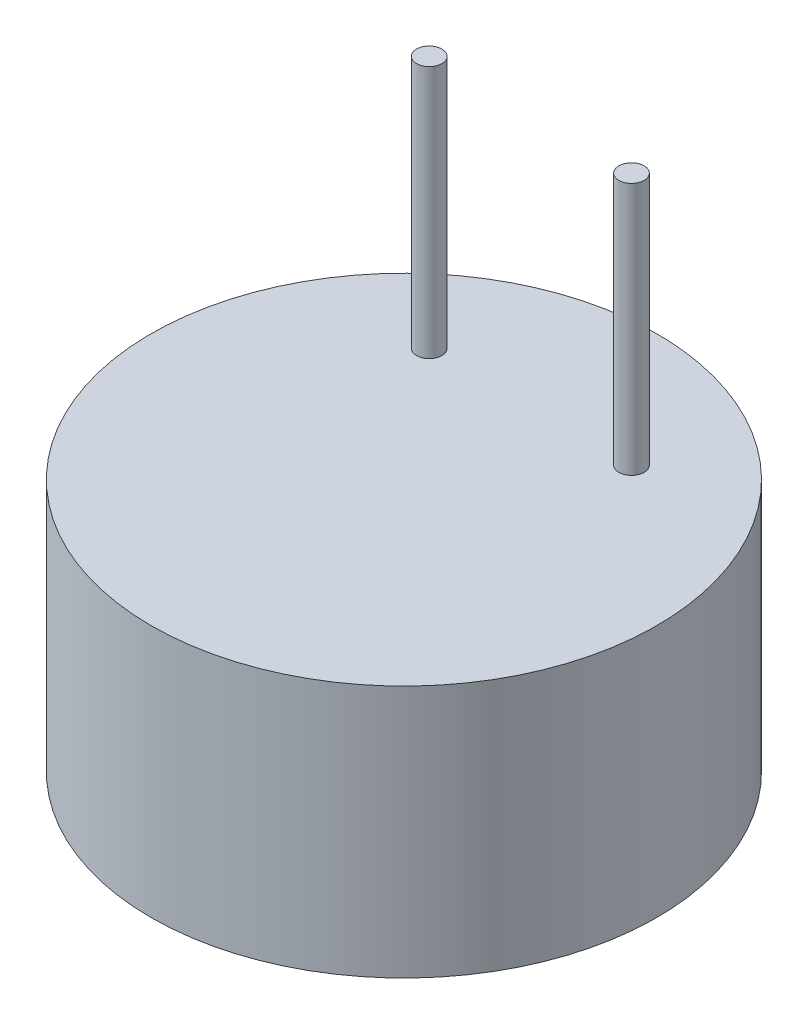
ISO-10303-21;
HEADER;
FILE_DESCRIPTION(('STEP AP214'),'2;1');
FILE_NAME('part.step','',(''),(''),'','','');
FILE_SCHEMA(('AUTOMOTIVE_DESIGN { 1 0 10303 214 1 1 1 1 }'));
ENDSEC;
DATA;
#1=APPLICATION_CONTEXT('core data for automotive mechanical design processes');
#2=APPLICATION_PROTOCOL_DEFINITION('international standard','automotive_design',2000,#1);
#3=PRODUCT_CONTEXT('',#1,'mechanical');
#4=PRODUCT('Part','Part','',(#3));
#5=PRODUCT_RELATED_PRODUCT_CATEGORY('part','',(#4));
#6=PRODUCT_DEFINITION_FORMATION('','',#4);
#7=PRODUCT_DEFINITION_CONTEXT('part definition',#1,'design');
#8=PRODUCT_DEFINITION('design','',#6,#7);
#9=PRODUCT_DEFINITION_SHAPE('','',#8);
#10=(LENGTH_UNIT() NAMED_UNIT(*) SI_UNIT(.MILLI.,.METRE.));
#11=(NAMED_UNIT(*) PLANE_ANGLE_UNIT() SI_UNIT($,.RADIAN.));
#12=(NAMED_UNIT(*) SI_UNIT($,.STERADIAN.) SOLID_ANGLE_UNIT());
#13=UNCERTAINTY_MEASURE_WITH_UNIT(LENGTH_MEASURE(1.E-05),#10,'distance_accuracy_value','');
#14=(GEOMETRIC_REPRESENTATION_CONTEXT(3) GLOBAL_UNCERTAINTY_ASSIGNED_CONTEXT((#13)) GLOBAL_UNIT_ASSIGNED_CONTEXT((#10,
#11,#12)) REPRESENTATION_CONTEXT('',''));
#15=CARTESIAN_POINT('',(0.,0.,0.));
#16=DIRECTION('',(0.,0.,1.));
#17=DIRECTION('',(1.,0.,0.));
#18=AXIS2_PLACEMENT_3D('',#15,#16,#17);
#19=CARTESIAN_POINT('',(0.,5.,0.));
#20=DIRECTION('',(0.,-1.,0.));
#21=DIRECTION('',(0.,0.,-1.));
#22=AXIS2_PLACEMENT_3D('',#19,#20,#21);
#23=CYLINDRICAL_SURFACE('',#22,5.);
#24=CARTESIAN_POINT('',(0.,5.,0.));
#25=DIRECTION('',(0.,1.,0.));
#26=DIRECTION('',(0.,0.,1.));
#27=AXIS2_PLACEMENT_3D('',#24,#25,#26);
#28=CIRCLE('',#27,5.);
#29=CARTESIAN_POINT('',(0.,5.,5.));
#30=VERTEX_POINT('',#29);
#31=EDGE_CURVE('E10',#30,#30,#28,.T.);
#32=ORIENTED_EDGE('',*,*,#31,.F.);
#33=EDGE_LOOP('',(#32));
#34=FACE_BOUND('',#33,.T.);
#35=CARTESIAN_POINT('',(0.,0.,0.));
#36=DIRECTION('',(0.,1.,0.));
#37=DIRECTION('',(0.,0.,1.));
#38=AXIS2_PLACEMENT_3D('',#35,#36,#37);
#39=CIRCLE('',#38,5.);
#40=CARTESIAN_POINT('',(0.,0.,5.));
#41=VERTEX_POINT('',#40);
#42=EDGE_CURVE('E44',#41,#41,#39,.T.);
#43=ORIENTED_EDGE('',*,*,#42,.T.);
#44=EDGE_LOOP('',(#43));
#45=FACE_BOUND('',#44,.T.);
#46=ADVANCED_FACE('F41',(#34,#45),#23,.T.);
#47=CARTESIAN_POINT('',(0.,5.,0.));
#48=DIRECTION('',(0.,1.,0.));
#49=DIRECTION('',(0.,0.,1.));
#50=AXIS2_PLACEMENT_3D('',#47,#48,#49);
#51=PLANE('',#50);
#52=CARTESIAN_POINT('',(2.,5.,-2.5));
#53=DIRECTION('',(0.,1.,0.));
#54=DIRECTION('',(0.,0.,-1.));
#55=AXIS2_PLACEMENT_3D('',#52,#53,#54);
#56=CIRCLE('',#55,0.25);
#57=CARTESIAN_POINT('',(2.,5.,-2.75));
#58=VERTEX_POINT('',#57);
#59=EDGE_CURVE('E59',#58,#58,#56,.T.);
#60=ORIENTED_EDGE('',*,*,#59,.F.);
#61=EDGE_LOOP('',(#60));
#62=FACE_BOUND('',#61,.T.);
#63=CARTESIAN_POINT('',(-2.,5.,-2.5));
#64=DIRECTION('',(0.,1.,0.));
#65=DIRECTION('',(0.,0.,1.));
#66=AXIS2_PLACEMENT_3D('',#63,#64,#65);
#67=CIRCLE('',#66,0.25);
#68=CARTESIAN_POINT('',(-2.,5.,-2.25));
#69=VERTEX_POINT('',#68);
#70=EDGE_CURVE('E55',#69,#69,#67,.T.);
#71=ORIENTED_EDGE('',*,*,#70,.F.);
#72=EDGE_LOOP('',(#71));
#73=FACE_BOUND('',#72,.T.);
#74=ORIENTED_EDGE('',*,*,#31,.T.);
#75=EDGE_LOOP('',(#74));
#76=FACE_BOUND('',#75,.T.);
#77=ADVANCED_FACE('F73',(#62,#73,#76),#51,.T.);
#78=CARTESIAN_POINT('',(0.,0.,0.));
#79=DIRECTION('',(0.,1.,0.));
#80=DIRECTION('',(0.,0.,1.));
#81=AXIS2_PLACEMENT_3D('',#78,#79,#80);
#82=PLANE('',#81);
#83=ORIENTED_EDGE('',*,*,#42,.F.);
#84=EDGE_LOOP('',(#83));
#85=FACE_BOUND('',#84,.T.);
#86=ADVANCED_FACE('F76',(#85),#82,.F.);
#87=CARTESIAN_POINT('',(-2.,10.,-2.5));
#88=DIRECTION('',(0.,-1.,0.));
#89=DIRECTION('',(0.,0.,-1.));
#90=AXIS2_PLACEMENT_3D('',#87,#88,#89);
#91=CYLINDRICAL_SURFACE('',#90,0.25);
#92=CARTESIAN_POINT('',(-2.,10.,-2.5));
#93=DIRECTION('',(0.,1.,0.));
#94=DIRECTION('',(0.,0.,1.));
#95=AXIS2_PLACEMENT_3D('',#92,#93,#94);
#96=CIRCLE('',#95,0.25);
#97=CARTESIAN_POINT('',(-2.,10.,-2.25));
#98=VERTEX_POINT('',#97);
#99=EDGE_CURVE('E53',#98,#98,#96,.T.);
#100=ORIENTED_EDGE('',*,*,#99,.F.);
#101=EDGE_LOOP('',(#100));
#102=FACE_BOUND('',#101,.T.);
#103=ORIENTED_EDGE('',*,*,#70,.T.);
#104=EDGE_LOOP('',(#103));
#105=FACE_BOUND('',#104,.T.);
#106=ADVANCED_FACE('F80',(#102,#105),#91,.T.);
#107=CARTESIAN_POINT('',(-2.,10.,-2.5));
#108=DIRECTION('',(0.,1.,0.));
#109=DIRECTION('',(0.,0.,1.));
#110=AXIS2_PLACEMENT_3D('',#107,#108,#109);
#111=PLANE('',#110);
#112=ORIENTED_EDGE('',*,*,#99,.T.);
#113=EDGE_LOOP('',(#112));
#114=FACE_BOUND('',#113,.T.);
#115=ADVANCED_FACE('F82',(#114),#111,.T.);
#116=CARTESIAN_POINT('',(2.,10.,-2.5));
#117=DIRECTION('',(0.,-1.,0.));
#118=DIRECTION('',(0.,0.,-1.));
#119=AXIS2_PLACEMENT_3D('',#116,#117,#118);
#120=CYLINDRICAL_SURFACE('',#119,0.25);
#121=CARTESIAN_POINT('',(2.,10.,-2.5));
#122=DIRECTION('',(0.,1.,0.));
#123=DIRECTION('',(0.,0.,-1.));
#124=AXIS2_PLACEMENT_3D('',#121,#122,#123);
#125=CIRCLE('',#124,0.25);
#126=CARTESIAN_POINT('',(2.,10.,-2.75));
#127=VERTEX_POINT('',#126);
#128=EDGE_CURVE('E63',#127,#127,#125,.T.);
#129=ORIENTED_EDGE('',*,*,#128,.F.);
#130=EDGE_LOOP('',(#129));
#131=FACE_BOUND('',#130,.T.);
#132=ORIENTED_EDGE('',*,*,#59,.T.);
#133=EDGE_LOOP('',(#132));
#134=FACE_BOUND('',#133,.T.);
#135=ADVANCED_FACE('F71',(#131,#134),#120,.T.);
#136=CARTESIAN_POINT('',(2.,10.,-2.5));
#137=DIRECTION('',(0.,-1.,0.));
#138=DIRECTION('',(0.,0.,-1.));
#139=AXIS2_PLACEMENT_3D('',#136,#137,#138);
#140=PLANE('',#139);
#141=ORIENTED_EDGE('',*,*,#128,.T.);
#142=EDGE_LOOP('',(#141));
#143=FACE_BOUND('',#142,.T.);
#144=ADVANCED_FACE('F136',(#143),#140,.F.);
#145=CLOSED_SHELL('',(#46,#77,#86,#106,#115,#135,#144));
#146=MANIFOLD_SOLID_BREP('B2',#145);
#147=ADVANCED_BREP_SHAPE_REPRESENTATION('',(#18,#146),#14);
#148=SHAPE_DEFINITION_REPRESENTATION(#9,#147);
ENDSEC;
END-ISO-10303-21;
